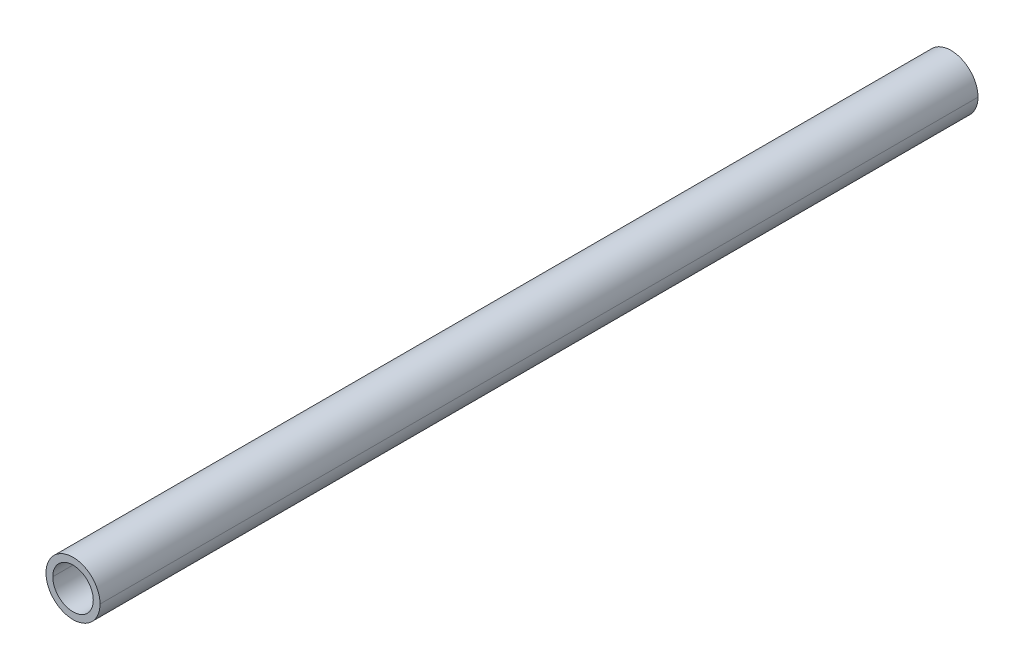
ISO-10303-21;
HEADER;
FILE_DESCRIPTION(('STEP AP214'),'2;1');
FILE_NAME('part.step','',(''),(''),'','','');
FILE_SCHEMA(('AUTOMOTIVE_DESIGN { 1 0 10303 214 1 1 1 1 }'));
ENDSEC;
DATA;
#1=APPLICATION_CONTEXT('core data for automotive mechanical design processes');
#2=APPLICATION_PROTOCOL_DEFINITION('international standard','automotive_design',2000,#1);
#3=PRODUCT_CONTEXT('',#1,'mechanical');
#4=PRODUCT('Part','Part','',(#3));
#5=PRODUCT_RELATED_PRODUCT_CATEGORY('part','',(#4));
#6=PRODUCT_DEFINITION_FORMATION('','',#4);
#7=PRODUCT_DEFINITION_CONTEXT('part definition',#1,'design');
#8=PRODUCT_DEFINITION('design','',#6,#7);
#9=PRODUCT_DEFINITION_SHAPE('','',#8);
#10=(LENGTH_UNIT() NAMED_UNIT(*) SI_UNIT(.MILLI.,.METRE.));
#11=(NAMED_UNIT(*) PLANE_ANGLE_UNIT() SI_UNIT($,.RADIAN.));
#12=(NAMED_UNIT(*) SI_UNIT($,.STERADIAN.) SOLID_ANGLE_UNIT());
#13=UNCERTAINTY_MEASURE_WITH_UNIT(LENGTH_MEASURE(1.E-05),#10,'distance_accuracy_value','');
#14=(GEOMETRIC_REPRESENTATION_CONTEXT(3) GLOBAL_UNCERTAINTY_ASSIGNED_CONTEXT((#13)) GLOBAL_UNIT_ASSIGNED_CONTEXT((#10,
#11,#12)) REPRESENTATION_CONTEXT('',''));
#15=CARTESIAN_POINT('',(0.,0.,0.));
#16=DIRECTION('',(0.,0.,1.));
#17=DIRECTION('',(1.,0.,0.));
#18=AXIS2_PLACEMENT_3D('',#15,#16,#17);
#19=CARTESIAN_POINT('',(0.,0.,-65.));
#20=DIRECTION('',(0.,0.,1.));
#21=DIRECTION('',(1.,0.,0.));
#22=AXIS2_PLACEMENT_3D('',#19,#20,#21);
#23=CYLINDRICAL_SURFACE('',#22,4.);
#24=DIRECTION('',(0.,0.,1.));
#25=VECTOR('',#24,1.);
#26=CARTESIAN_POINT('',(4.,0.,-65.));
#27=LINE('',#26,#25);
#28=CARTESIAN_POINT('',(4.,0.,-65.));
#29=VERTEX_POINT('',#28);
#30=CARTESIAN_POINT('',(4.,0.,65.));
#31=VERTEX_POINT('',#30);
#32=EDGE_CURVE('E11',#29,#31,#27,.T.);
#33=ORIENTED_EDGE('',*,*,#32,.T.);
#34=CARTESIAN_POINT('',(0.,0.,65.));
#35=DIRECTION('',(0.,0.,1.));
#36=DIRECTION('',(-1.,0.,0.));
#37=AXIS2_PLACEMENT_3D('',#34,#35,#36);
#38=CIRCLE('',#37,4.);
#39=CARTESIAN_POINT('',(-4.,0.,65.));
#40=VERTEX_POINT('',#39);
#41=EDGE_CURVE('E20',#40,#31,#38,.T.);
#42=ORIENTED_EDGE('',*,*,#41,.F.);
#43=DIRECTION('',(0.,0.,1.));
#44=VECTOR('',#43,1.);
#45=CARTESIAN_POINT('',(-4.,0.,-65.));
#46=LINE('',#45,#44);
#47=CARTESIAN_POINT('',(-4.,0.,-65.));
#48=VERTEX_POINT('',#47);
#49=EDGE_CURVE('E27',#48,#40,#46,.T.);
#50=ORIENTED_EDGE('',*,*,#49,.F.);
#51=CARTESIAN_POINT('',(0.,0.,-65.));
#52=DIRECTION('',(0.,0.,1.));
#53=DIRECTION('',(-1.,0.,0.));
#54=AXIS2_PLACEMENT_3D('',#51,#52,#53);
#55=CIRCLE('',#54,4.);
#56=EDGE_CURVE('E104',#48,#29,#55,.T.);
#57=ORIENTED_EDGE('',*,*,#56,.T.);
#58=EDGE_LOOP('',(#33,#42,#50,#57));
#59=FACE_BOUND('',#58,.T.);
#60=ADVANCED_FACE('F16',(#59),#23,.T.);
#61=CARTESIAN_POINT('',(0.,0.,-65.));
#62=DIRECTION('',(0.,0.,1.));
#63=DIRECTION('',(1.,0.,0.));
#64=AXIS2_PLACEMENT_3D('',#61,#62,#63);
#65=CYLINDRICAL_SURFACE('',#64,4.);
#66=ORIENTED_EDGE('',*,*,#49,.T.);
#67=CARTESIAN_POINT('',(0.,0.,65.));
#68=DIRECTION('',(0.,0.,1.));
#69=DIRECTION('',(1.,0.,0.));
#70=AXIS2_PLACEMENT_3D('',#67,#68,#69);
#71=CIRCLE('',#70,4.);
#72=EDGE_CURVE('E114',#31,#40,#71,.T.);
#73=ORIENTED_EDGE('',*,*,#72,.F.);
#74=ORIENTED_EDGE('',*,*,#32,.F.);
#75=CARTESIAN_POINT('',(0.,0.,-65.));
#76=DIRECTION('',(0.,0.,1.));
#77=DIRECTION('',(1.,0.,0.));
#78=AXIS2_PLACEMENT_3D('',#75,#76,#77);
#79=CIRCLE('',#78,4.);
#80=EDGE_CURVE('E102',#29,#48,#79,.T.);
#81=ORIENTED_EDGE('',*,*,#80,.T.);
#82=EDGE_LOOP('',(#66,#73,#74,#81));
#83=FACE_BOUND('',#82,.T.);
#84=ADVANCED_FACE('F119',(#83),#65,.T.);
#85=CARTESIAN_POINT('',(0.,0.,65.));
#86=DIRECTION('',(0.,0.,1.));
#87=DIRECTION('',(1.,0.,0.));
#88=AXIS2_PLACEMENT_3D('',#85,#86,#87);
#89=PLANE('',#88);
#90=CARTESIAN_POINT('',(0.,0.,65.));
#91=DIRECTION('',(0.,0.,-1.));
#92=DIRECTION('',(-1.,0.,0.));
#93=AXIS2_PLACEMENT_3D('',#90,#91,#92);
#94=CIRCLE('',#93,3.);
#95=CARTESIAN_POINT('',(-3.,0.,65.));
#96=VERTEX_POINT('',#95);
#97=CARTESIAN_POINT('',(3.,0.,65.));
#98=VERTEX_POINT('',#97);
#99=EDGE_CURVE('E76',#96,#98,#94,.T.);
#100=ORIENTED_EDGE('',*,*,#99,.T.);
#101=CARTESIAN_POINT('',(0.,0.,65.));
#102=DIRECTION('',(0.,0.,-1.));
#103=DIRECTION('',(1.,0.,0.));
#104=AXIS2_PLACEMENT_3D('',#101,#102,#103);
#105=CIRCLE('',#104,3.);
#106=EDGE_CURVE('E84',#98,#96,#105,.T.);
#107=ORIENTED_EDGE('',*,*,#106,.T.);
#108=EDGE_LOOP('',(#100,#107));
#109=FACE_BOUND('',#108,.T.);
#110=ORIENTED_EDGE('',*,*,#41,.T.);
#111=ORIENTED_EDGE('',*,*,#72,.T.);
#112=EDGE_LOOP('',(#110,#111));
#113=FACE_BOUND('',#112,.T.);
#114=ADVANCED_FACE('F18',(#109,#113),#89,.T.);
#115=CARTESIAN_POINT('',(0.,0.,-65.));
#116=DIRECTION('',(0.,0.,1.));
#117=DIRECTION('',(1.,0.,0.));
#118=AXIS2_PLACEMENT_3D('',#115,#116,#117);
#119=CYLINDRICAL_SURFACE('',#118,3.);
#120=DIRECTION('',(0.,0.,1.));
#121=VECTOR('',#120,1.);
#122=CARTESIAN_POINT('',(3.,0.,-65.));
#123=LINE('',#122,#121);
#124=CARTESIAN_POINT('',(3.,0.,-65.));
#125=VERTEX_POINT('',#124);
#126=EDGE_CURVE('E81',#125,#98,#123,.T.);
#127=ORIENTED_EDGE('',*,*,#126,.T.);
#128=ORIENTED_EDGE('',*,*,#99,.F.);
#129=DIRECTION('',(0.,0.,1.));
#130=VECTOR('',#129,1.);
#131=CARTESIAN_POINT('',(-3.,0.,-65.));
#132=LINE('',#131,#130);
#133=CARTESIAN_POINT('',(-3.,0.,-65.));
#134=VERTEX_POINT('',#133);
#135=EDGE_CURVE('E55',#134,#96,#132,.T.);
#136=ORIENTED_EDGE('',*,*,#135,.F.);
#137=CARTESIAN_POINT('',(0.,0.,-65.));
#138=DIRECTION('',(0.,0.,-1.));
#139=DIRECTION('',(-1.,0.,0.));
#140=AXIS2_PLACEMENT_3D('',#137,#138,#139);
#141=CIRCLE('',#140,3.);
#142=EDGE_CURVE('E98',#134,#125,#141,.T.);
#143=ORIENTED_EDGE('',*,*,#142,.T.);
#144=EDGE_LOOP('',(#127,#128,#136,#143));
#145=FACE_BOUND('',#144,.T.);
#146=ADVANCED_FACE('F80',(#145),#119,.F.);
#147=CARTESIAN_POINT('',(0.,0.,-65.));
#148=DIRECTION('',(0.,0.,1.));
#149=DIRECTION('',(1.,0.,0.));
#150=AXIS2_PLACEMENT_3D('',#147,#148,#149);
#151=CYLINDRICAL_SURFACE('',#150,3.);
#152=ORIENTED_EDGE('',*,*,#135,.T.);
#153=ORIENTED_EDGE('',*,*,#106,.F.);
#154=ORIENTED_EDGE('',*,*,#126,.F.);
#155=CARTESIAN_POINT('',(0.,0.,-65.));
#156=DIRECTION('',(0.,0.,-1.));
#157=DIRECTION('',(1.,0.,0.));
#158=AXIS2_PLACEMENT_3D('',#155,#156,#157);
#159=CIRCLE('',#158,3.);
#160=EDGE_CURVE('E91',#125,#134,#159,.T.);
#161=ORIENTED_EDGE('',*,*,#160,.T.);
#162=EDGE_LOOP('',(#152,#153,#154,#161));
#163=FACE_BOUND('',#162,.T.);
#164=ADVANCED_FACE('F89',(#163),#151,.F.);
#165=CARTESIAN_POINT('',(0.,0.,-65.));
#166=DIRECTION('',(0.,0.,1.));
#167=DIRECTION('',(1.,0.,0.));
#168=AXIS2_PLACEMENT_3D('',#165,#166,#167);
#169=PLANE('',#168);
#170=ORIENTED_EDGE('',*,*,#142,.F.);
#171=ORIENTED_EDGE('',*,*,#160,.F.);
#172=EDGE_LOOP('',(#170,#171));
#173=FACE_BOUND('',#172,.T.);
#174=ORIENTED_EDGE('',*,*,#56,.F.);
#175=ORIENTED_EDGE('',*,*,#80,.F.);
#176=EDGE_LOOP('',(#174,#175));
#177=FACE_BOUND('',#176,.T.);
#178=ADVANCED_FACE('F138',(#173,#177),#169,.F.);
#179=CLOSED_SHELL('',(#60,#84,#114,#146,#164,#178));
#180=MANIFOLD_SOLID_BREP('B1',#179);
#181=ADVANCED_BREP_SHAPE_REPRESENTATION('',(#18,#180),#14);
#182=SHAPE_DEFINITION_REPRESENTATION(#9,#181);
ENDSEC;
END-ISO-10303-21;
